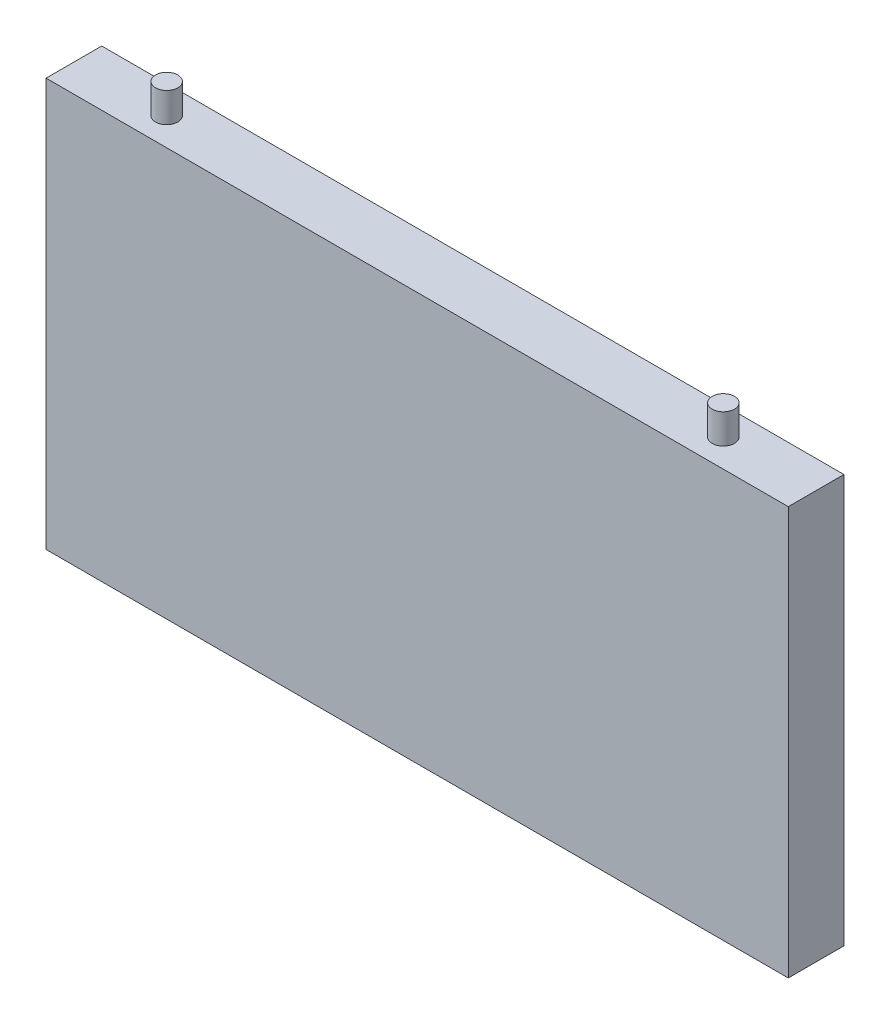
ISO-10303-21;
HEADER;
FILE_DESCRIPTION(('STEP AP214'),'2;1');
FILE_NAME('part.step','',(''),(''),'','','');
FILE_SCHEMA(('AUTOMOTIVE_DESIGN { 1 0 10303 214 1 1 1 1 }'));
ENDSEC;
DATA;
#1=APPLICATION_CONTEXT('core data for automotive mechanical design processes');
#2=APPLICATION_PROTOCOL_DEFINITION('international standard','automotive_design',2000,#1);
#3=PRODUCT_CONTEXT('',#1,'mechanical');
#4=PRODUCT('Part','Part','',(#3));
#5=PRODUCT_RELATED_PRODUCT_CATEGORY('part','',(#4));
#6=PRODUCT_DEFINITION_FORMATION('','',#4);
#7=PRODUCT_DEFINITION_CONTEXT('part definition',#1,'design');
#8=PRODUCT_DEFINITION('design','',#6,#7);
#9=PRODUCT_DEFINITION_SHAPE('','',#8);
#10=(LENGTH_UNIT() NAMED_UNIT(*) SI_UNIT(.MILLI.,.METRE.));
#11=(NAMED_UNIT(*) PLANE_ANGLE_UNIT() SI_UNIT($,.RADIAN.));
#12=(NAMED_UNIT(*) SI_UNIT($,.STERADIAN.) SOLID_ANGLE_UNIT());
#13=UNCERTAINTY_MEASURE_WITH_UNIT(LENGTH_MEASURE(1.E-05),#10,'distance_accuracy_value','');
#14=(GEOMETRIC_REPRESENTATION_CONTEXT(3) GLOBAL_UNCERTAINTY_ASSIGNED_CONTEXT((#13)) GLOBAL_UNIT_ASSIGNED_CONTEXT((#10,
#11,#12)) REPRESENTATION_CONTEXT('',''));
#15=CARTESIAN_POINT('',(0.,0.,0.));
#16=DIRECTION('',(0.,0.,1.));
#17=DIRECTION('',(1.,0.,0.));
#18=AXIS2_PLACEMENT_3D('',#15,#16,#17);
#19=CARTESIAN_POINT('',(0.,0.,15.));
#20=DIRECTION('',(1.,0.,0.));
#21=DIRECTION('',(0.,0.,-1.));
#22=AXIS2_PLACEMENT_3D('',#19,#20,#21);
#23=PLANE('',#22);
#24=DIRECTION('',(0.,-1.,0.));
#25=VECTOR('',#24,1.);
#26=CARTESIAN_POINT('',(0.,0.,0.));
#27=LINE('',#26,#25);
#28=CARTESIAN_POINT('',(0.,110.,0.));
#29=VERTEX_POINT('',#28);
#30=CARTESIAN_POINT('',(0.,0.,0.));
#31=VERTEX_POINT('',#30);
#32=EDGE_CURVE('E105',#29,#31,#27,.T.);
#33=ORIENTED_EDGE('',*,*,#32,.T.);
#34=DIRECTION('',(0.,0.,-1.));
#35=VECTOR('',#34,1.);
#36=CARTESIAN_POINT('',(0.,0.,15.));
#37=LINE('',#36,#35);
#38=CARTESIAN_POINT('',(0.,0.,15.));
#39=VERTEX_POINT('',#38);
#40=EDGE_CURVE('E96',#39,#31,#37,.T.);
#41=ORIENTED_EDGE('',*,*,#40,.F.);
#42=DIRECTION('',(0.,-1.,0.));
#43=VECTOR('',#42,1.);
#44=CARTESIAN_POINT('',(0.,0.,15.));
#45=LINE('',#44,#43);
#46=CARTESIAN_POINT('',(0.,110.,15.));
#47=VERTEX_POINT('',#46);
#48=EDGE_CURVE('E90',#47,#39,#45,.T.);
#49=ORIENTED_EDGE('',*,*,#48,.F.);
#50=DIRECTION('',(0.,0.,-1.));
#51=VECTOR('',#50,1.);
#52=CARTESIAN_POINT('',(0.,110.,15.));
#53=LINE('',#52,#51);
#54=EDGE_CURVE('E101',#47,#29,#53,.T.);
#55=ORIENTED_EDGE('',*,*,#54,.T.);
#56=EDGE_LOOP('',(#33,#41,#49,#55));
#57=FACE_BOUND('',#56,.T.);
#58=ADVANCED_FACE('F38',(#57),#23,.F.);
#59=CARTESIAN_POINT('',(0.,0.,15.));
#60=DIRECTION('',(0.,1.,0.));
#61=DIRECTION('',(0.,0.,1.));
#62=AXIS2_PLACEMENT_3D('',#59,#60,#61);
#63=PLANE('',#62);
#64=DIRECTION('',(1.,0.,0.));
#65=VECTOR('',#64,1.);
#66=CARTESIAN_POINT('',(0.,0.,0.));
#67=LINE('',#66,#65);
#68=CARTESIAN_POINT('',(200.,0.,0.));
#69=VERTEX_POINT('',#68);
#70=EDGE_CURVE('E95',#31,#69,#67,.T.);
#71=ORIENTED_EDGE('',*,*,#70,.T.);
#72=DIRECTION('',(0.,0.,-1.));
#73=VECTOR('',#72,1.);
#74=CARTESIAN_POINT('',(200.,0.,15.));
#75=LINE('',#74,#73);
#76=CARTESIAN_POINT('',(200.,0.,15.));
#77=VERTEX_POINT('',#76);
#78=EDGE_CURVE('E93',#77,#69,#75,.T.);
#79=ORIENTED_EDGE('',*,*,#78,.F.);
#80=DIRECTION('',(1.,0.,0.));
#81=VECTOR('',#80,1.);
#82=CARTESIAN_POINT('',(0.,0.,15.));
#83=LINE('',#82,#81);
#84=EDGE_CURVE('E85',#39,#77,#83,.T.);
#85=ORIENTED_EDGE('',*,*,#84,.F.);
#86=ORIENTED_EDGE('',*,*,#40,.T.);
#87=EDGE_LOOP('',(#71,#79,#85,#86));
#88=FACE_BOUND('',#87,.T.);
#89=ADVANCED_FACE('F94',(#88),#63,.F.);
#90=CARTESIAN_POINT('',(200.,0.,15.));
#91=DIRECTION('',(-1.,0.,0.));
#92=DIRECTION('',(0.,0.,1.));
#93=AXIS2_PLACEMENT_3D('',#90,#91,#92);
#94=PLANE('',#93);
#95=DIRECTION('',(0.,1.,0.));
#96=VECTOR('',#95,1.);
#97=CARTESIAN_POINT('',(200.,0.,0.));
#98=LINE('',#97,#96);
#99=CARTESIAN_POINT('',(200.,110.,0.));
#100=VERTEX_POINT('',#99);
#101=EDGE_CURVE('E71',#69,#100,#98,.T.);
#102=ORIENTED_EDGE('',*,*,#101,.T.);
#103=DIRECTION('',(0.,0.,-1.));
#104=VECTOR('',#103,1.);
#105=CARTESIAN_POINT('',(200.,110.,15.));
#106=LINE('',#105,#104);
#107=CARTESIAN_POINT('',(200.,110.,15.));
#108=VERTEX_POINT('',#107);
#109=EDGE_CURVE('E97',#108,#100,#106,.T.);
#110=ORIENTED_EDGE('',*,*,#109,.F.);
#111=DIRECTION('',(0.,1.,0.));
#112=VECTOR('',#111,1.);
#113=CARTESIAN_POINT('',(200.,0.,15.));
#114=LINE('',#113,#112);
#115=EDGE_CURVE('E88',#77,#108,#114,.T.);
#116=ORIENTED_EDGE('',*,*,#115,.F.);
#117=ORIENTED_EDGE('',*,*,#78,.T.);
#118=EDGE_LOOP('',(#102,#110,#116,#117));
#119=FACE_BOUND('',#118,.T.);
#120=ADVANCED_FACE('F99',(#119),#94,.F.);
#121=CARTESIAN_POINT('',(0.,110.,15.));
#122=DIRECTION('',(0.,-1.,0.));
#123=DIRECTION('',(0.,0.,-1.));
#124=AXIS2_PLACEMENT_3D('',#121,#122,#123);
#125=PLANE('',#124);
#126=CARTESIAN_POINT('',(25.,110.,7.50000000000002));
#127=DIRECTION('',(0.,-1.,0.));
#128=DIRECTION('',(0.,0.,-1.));
#129=AXIS2_PLACEMENT_3D('',#126,#127,#128);
#130=CIRCLE('',#129,3.);
#131=CARTESIAN_POINT('',(25.,110.,4.50000000000002));
#132=VERTEX_POINT('',#131);
#133=EDGE_CURVE('E11',#132,#132,#130,.F.);
#134=ORIENTED_EDGE('',*,*,#133,.F.);
#135=EDGE_LOOP('',(#134));
#136=FACE_BOUND('',#135,.T.);
#137=CARTESIAN_POINT('',(175.,110.,7.5));
#138=DIRECTION('',(0.,-1.,0.));
#139=DIRECTION('',(0.,0.,-1.));
#140=AXIS2_PLACEMENT_3D('',#137,#138,#139);
#141=CIRCLE('',#140,2.99999999999999);
#142=CARTESIAN_POINT('',(175.,110.,4.50000000000001));
#143=VERTEX_POINT('',#142);
#144=EDGE_CURVE('E46',#143,#143,#141,.F.);
#145=ORIENTED_EDGE('',*,*,#144,.F.);
#146=EDGE_LOOP('',(#145));
#147=FACE_BOUND('',#146,.T.);
#148=DIRECTION('',(-1.,0.,0.));
#149=VECTOR('',#148,1.);
#150=CARTESIAN_POINT('',(0.,110.,0.));
#151=LINE('',#150,#149);
#152=EDGE_CURVE('E77',#100,#29,#151,.T.);
#153=ORIENTED_EDGE('',*,*,#152,.T.);
#154=ORIENTED_EDGE('',*,*,#54,.F.);
#155=DIRECTION('',(-1.,0.,0.));
#156=VECTOR('',#155,1.);
#157=CARTESIAN_POINT('',(0.,110.,15.));
#158=LINE('',#157,#156);
#159=EDGE_CURVE('E54',#108,#47,#158,.T.);
#160=ORIENTED_EDGE('',*,*,#159,.F.);
#161=ORIENTED_EDGE('',*,*,#109,.T.);
#162=EDGE_LOOP('',(#153,#154,#160,#161));
#163=FACE_BOUND('',#162,.T.);
#164=ADVANCED_FACE('F119',(#136,#147,#163),#125,.F.);
#165=CARTESIAN_POINT('',(0.,0.,15.));
#166=DIRECTION('',(0.,0.,-1.));
#167=DIRECTION('',(-1.,0.,0.));
#168=AXIS2_PLACEMENT_3D('',#165,#166,#167);
#169=PLANE('',#168);
#170=ORIENTED_EDGE('',*,*,#48,.T.);
#171=ORIENTED_EDGE('',*,*,#84,.T.);
#172=ORIENTED_EDGE('',*,*,#115,.T.);
#173=ORIENTED_EDGE('',*,*,#159,.T.);
#174=EDGE_LOOP('',(#170,#171,#172,#173));
#175=FACE_BOUND('',#174,.T.);
#176=ADVANCED_FACE('F86',(#175),#169,.F.);
#177=CARTESIAN_POINT('',(0.,0.,0.));
#178=DIRECTION('',(0.,0.,-1.));
#179=DIRECTION('',(-1.,0.,0.));
#180=AXIS2_PLACEMENT_3D('',#177,#178,#179);
#181=PLANE('',#180);
#182=ORIENTED_EDGE('',*,*,#32,.F.);
#183=ORIENTED_EDGE('',*,*,#152,.F.);
#184=ORIENTED_EDGE('',*,*,#101,.F.);
#185=ORIENTED_EDGE('',*,*,#70,.F.);
#186=EDGE_LOOP('',(#182,#183,#184,#185));
#187=FACE_BOUND('',#186,.T.);
#188=ADVANCED_FACE('F127',(#187),#181,.T.);
#189=CARTESIAN_POINT('',(175.,118.,7.5));
#190=DIRECTION('',(0.,-1.,0.));
#191=DIRECTION('',(0.,0.,-1.));
#192=AXIS2_PLACEMENT_3D('',#189,#190,#191);
#193=CYLINDRICAL_SURFACE('',#192,2.99999999999999);
#194=CARTESIAN_POINT('',(175.,118.,7.5));
#195=DIRECTION('',(0.,1.,0.));
#196=DIRECTION('',(0.,0.,1.));
#197=AXIS2_PLACEMENT_3D('',#194,#195,#196);
#198=CIRCLE('',#197,2.99999999999999);
#199=CARTESIAN_POINT('',(175.,118.,10.5));
#200=VERTEX_POINT('',#199);
#201=EDGE_CURVE('E108',#200,#200,#198,.T.);
#202=ORIENTED_EDGE('',*,*,#201,.F.);
#203=EDGE_LOOP('',(#202));
#204=FACE_BOUND('',#203,.T.);
#205=ORIENTED_EDGE('',*,*,#144,.T.);
#206=EDGE_LOOP('',(#205));
#207=FACE_BOUND('',#206,.T.);
#208=ADVANCED_FACE('F117',(#204,#207),#193,.T.);
#209=CARTESIAN_POINT('',(0.,118.,0.));
#210=DIRECTION('',(0.,1.,0.));
#211=DIRECTION('',(0.,0.,1.));
#212=AXIS2_PLACEMENT_3D('',#209,#210,#211);
#213=PLANE('',#212);
#214=ORIENTED_EDGE('',*,*,#201,.T.);
#215=EDGE_LOOP('',(#214));
#216=FACE_BOUND('',#215,.T.);
#217=ADVANCED_FACE('F143',(#216),#213,.T.);
#218=CARTESIAN_POINT('',(25.,118.,7.50000000000002));
#219=DIRECTION('',(0.,-1.,0.));
#220=DIRECTION('',(0.,0.,-1.));
#221=AXIS2_PLACEMENT_3D('',#218,#219,#220);
#222=CYLINDRICAL_SURFACE('',#221,3.);
#223=CARTESIAN_POINT('',(25.,118.,7.50000000000002));
#224=DIRECTION('',(0.,1.,0.));
#225=DIRECTION('',(0.,0.,1.));
#226=AXIS2_PLACEMENT_3D('',#223,#224,#225);
#227=CIRCLE('',#226,3.);
#228=CARTESIAN_POINT('',(25.,118.,10.5));
#229=VERTEX_POINT('',#228);
#230=EDGE_CURVE('E162',#229,#229,#227,.T.);
#231=ORIENTED_EDGE('',*,*,#230,.F.);
#232=EDGE_LOOP('',(#231));
#233=FACE_BOUND('',#232,.T.);
#234=ORIENTED_EDGE('',*,*,#133,.T.);
#235=EDGE_LOOP('',(#234));
#236=FACE_BOUND('',#235,.T.);
#237=ADVANCED_FACE('F149',(#233,#236),#222,.T.);
#238=CARTESIAN_POINT('',(25.,118.,7.50000000000002));
#239=DIRECTION('',(0.,1.,0.));
#240=DIRECTION('',(0.,0.,1.));
#241=AXIS2_PLACEMENT_3D('',#238,#239,#240);
#242=PLANE('',#241);
#243=ORIENTED_EDGE('',*,*,#230,.T.);
#244=EDGE_LOOP('',(#243));
#245=FACE_BOUND('',#244,.T.);
#246=ADVANCED_FACE('F151',(#245),#242,.T.);
#247=CLOSED_SHELL('',(#58,#89,#120,#164,#176,#188,#208,#217,#237,#246));
#248=MANIFOLD_SOLID_BREP('B2',#247);
#249=ADVANCED_BREP_SHAPE_REPRESENTATION('',(#18,#248),#14);
#250=SHAPE_DEFINITION_REPRESENTATION(#9,#249);
ENDSEC;
END-ISO-10303-21;
